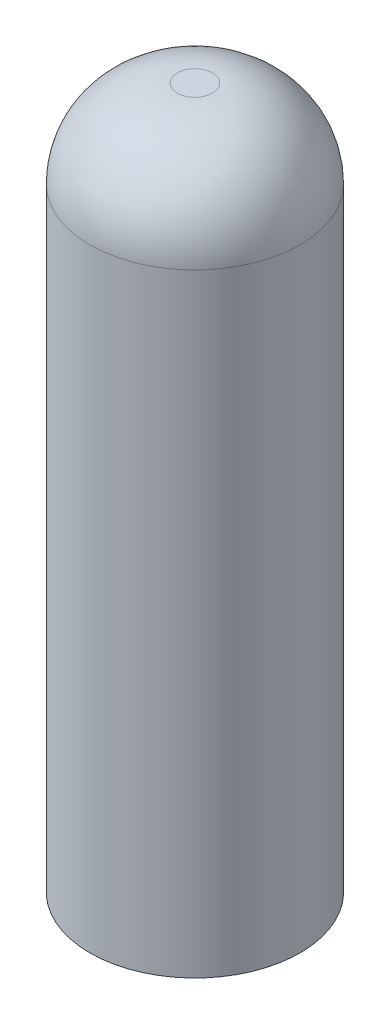
ISO-10303-21;
HEADER;
FILE_DESCRIPTION(('STEP AP214'),'2;1');
FILE_NAME('part.step','',(''),(''),'','','');
FILE_SCHEMA(('AUTOMOTIVE_DESIGN { 1 0 10303 214 1 1 1 1 }'));
ENDSEC;
DATA;
#1=APPLICATION_CONTEXT('core data for automotive mechanical design processes');
#2=APPLICATION_PROTOCOL_DEFINITION('international standard','automotive_design',2000,#1);
#3=PRODUCT_CONTEXT('',#1,'mechanical');
#4=PRODUCT('Part','Part','',(#3));
#5=PRODUCT_RELATED_PRODUCT_CATEGORY('part','',(#4));
#6=PRODUCT_DEFINITION_FORMATION('','',#4);
#7=PRODUCT_DEFINITION_CONTEXT('part definition',#1,'design');
#8=PRODUCT_DEFINITION('design','',#6,#7);
#9=PRODUCT_DEFINITION_SHAPE('','',#8);
#10=(LENGTH_UNIT() NAMED_UNIT(*) SI_UNIT(.MILLI.,.METRE.));
#11=(NAMED_UNIT(*) PLANE_ANGLE_UNIT() SI_UNIT($,.RADIAN.));
#12=(NAMED_UNIT(*) SI_UNIT($,.STERADIAN.) SOLID_ANGLE_UNIT());
#13=UNCERTAINTY_MEASURE_WITH_UNIT(LENGTH_MEASURE(1.E-05),#10,'distance_accuracy_value','');
#14=(GEOMETRIC_REPRESENTATION_CONTEXT(3) GLOBAL_UNCERTAINTY_ASSIGNED_CONTEXT((#13)) GLOBAL_UNIT_ASSIGNED_CONTEXT((#10,
#11,#12)) REPRESENTATION_CONTEXT('',''));
#15=CARTESIAN_POINT('',(0.,0.,0.));
#16=DIRECTION('',(0.,0.,1.));
#17=DIRECTION('',(1.,0.,0.));
#18=AXIS2_PLACEMENT_3D('',#15,#16,#17);
#19=CARTESIAN_POINT('',(0.,40.,0.));
#20=DIRECTION('',(0.,-1.,0.));
#21=DIRECTION('',(0.,0.,-1.));
#22=AXIS2_PLACEMENT_3D('',#19,#20,#21);
#23=CYLINDRICAL_SURFACE('',#22,6.);
#24=CARTESIAN_POINT('',(0.,35.,0.));
#25=DIRECTION('',(0.,1.,0.));
#26=DIRECTION('',(0.,0.,1.));
#27=AXIS2_PLACEMENT_3D('',#24,#25,#26);
#28=CIRCLE('',#27,6.);
#29=CARTESIAN_POINT('',(0.,35.,6.));
#30=VERTEX_POINT('',#29);
#31=EDGE_CURVE('E10',#30,#30,#28,.F.);
#32=ORIENTED_EDGE('',*,*,#31,.T.);
#33=EDGE_LOOP('',(#32));
#34=FACE_BOUND('',#33,.T.);
#35=CARTESIAN_POINT('',(0.,0.,0.));
#36=DIRECTION('',(0.,1.,0.));
#37=DIRECTION('',(0.,0.,1.));
#38=AXIS2_PLACEMENT_3D('',#35,#36,#37);
#39=CIRCLE('',#38,6.);
#40=CARTESIAN_POINT('',(0.,0.,6.));
#41=VERTEX_POINT('',#40);
#42=EDGE_CURVE('E50',#41,#41,#39,.T.);
#43=ORIENTED_EDGE('',*,*,#42,.T.);
#44=EDGE_LOOP('',(#43));
#45=FACE_BOUND('',#44,.T.);
#46=ADVANCED_FACE('F37',(#34,#45),#23,.T.);
#47=CARTESIAN_POINT('',(0.,40.,0.));
#48=DIRECTION('',(0.,1.,0.));
#49=DIRECTION('',(0.,0.,1.));
#50=AXIS2_PLACEMENT_3D('',#47,#48,#49);
#51=PLANE('',#50);
#52=CARTESIAN_POINT('',(0.,40.,0.));
#53=DIRECTION('',(0.,1.,0.));
#54=DIRECTION('',(0.,0.,1.));
#55=AXIS2_PLACEMENT_3D('',#52,#53,#54);
#56=CIRCLE('',#55,0.999999999999999);
#57=CARTESIAN_POINT('',(0.,40.,0.999999999999999));
#58=VERTEX_POINT('',#57);
#59=EDGE_CURVE('E45',#58,#58,#56,.T.);
#60=ORIENTED_EDGE('',*,*,#59,.T.);
#61=EDGE_LOOP('',(#60));
#62=FACE_BOUND('',#61,.T.);
#63=ADVANCED_FACE('F78',(#62),#51,.T.);
#64=CARTESIAN_POINT('',(0.,0.,0.));
#65=DIRECTION('',(0.,1.,0.));
#66=DIRECTION('',(0.,0.,1.));
#67=AXIS2_PLACEMENT_3D('',#64,#65,#66);
#68=PLANE('',#67);
#69=CARTESIAN_POINT('',(0.,0.,0.));
#70=DIRECTION('',(0.,1.,0.));
#71=DIRECTION('',(0.,0.,1.));
#72=AXIS2_PLACEMENT_3D('',#69,#70,#71);
#73=CIRCLE('',#72,5.);
#74=CARTESIAN_POINT('',(0.,0.,5.));
#75=VERTEX_POINT('',#74);
#76=EDGE_CURVE('E58',#75,#75,#73,.T.);
#77=ORIENTED_EDGE('',*,*,#76,.T.);
#78=EDGE_LOOP('',(#77));
#79=FACE_BOUND('',#78,.T.);
#80=ORIENTED_EDGE('',*,*,#42,.F.);
#81=EDGE_LOOP('',(#80));
#82=FACE_BOUND('',#81,.T.);
#83=ADVANCED_FACE('F82',(#79,#82),#68,.F.);
#84=CARTESIAN_POINT('',(0.,35.,0.));
#85=DIRECTION('',(0.,1.,0.));
#86=DIRECTION('',(0.,0.,1.));
#87=AXIS2_PLACEMENT_3D('',#84,#85,#86);
#88=DEGENERATE_TOROIDAL_SURFACE('',#87,0.999999999999999,5.,.T.);
#89=ORIENTED_EDGE('',*,*,#31,.F.);
#90=EDGE_LOOP('',(#89));
#91=FACE_BOUND('',#90,.T.);
#92=ORIENTED_EDGE('',*,*,#59,.F.);
#93=EDGE_LOOP('',(#92));
#94=FACE_BOUND('',#93,.T.);
#95=ADVANCED_FACE('F39',(#91,#94),#88,.T.);
#96=CARTESIAN_POINT('',(0.,40.,0.));
#97=DIRECTION('',(0.,-1.,0.));
#98=DIRECTION('',(0.,0.,-1.));
#99=AXIS2_PLACEMENT_3D('',#96,#97,#98);
#100=CYLINDRICAL_SURFACE('',#99,5.);
#101=CARTESIAN_POINT('',(0.,30.,0.));
#102=DIRECTION('',(0.,1.,0.));
#103=DIRECTION('',(0.,0.,1.));
#104=AXIS2_PLACEMENT_3D('',#101,#102,#103);
#105=CIRCLE('',#104,5.);
#106=CARTESIAN_POINT('',(0.,30.,5.));
#107=VERTEX_POINT('',#106);
#108=EDGE_CURVE('E55',#107,#107,#105,.T.);
#109=ORIENTED_EDGE('',*,*,#108,.T.);
#110=EDGE_LOOP('',(#109));
#111=FACE_BOUND('',#110,.T.);
#112=ORIENTED_EDGE('',*,*,#76,.F.);
#113=EDGE_LOOP('',(#112));
#114=FACE_BOUND('',#113,.T.);
#115=ADVANCED_FACE('F66',(#111,#114),#100,.F.);
#116=CARTESIAN_POINT('',(0.,30.,0.));
#117=DIRECTION('',(0.,1.,0.));
#118=DIRECTION('',(0.,0.,1.));
#119=AXIS2_PLACEMENT_3D('',#116,#117,#118);
#120=PLANE('',#119);
#121=ORIENTED_EDGE('',*,*,#108,.F.);
#122=EDGE_LOOP('',(#121));
#123=FACE_BOUND('',#122,.T.);
#124=ADVANCED_FACE('F69',(#123),#120,.F.);
#125=CLOSED_SHELL('',(#46,#63,#83,#95,#115,#124));
#126=MANIFOLD_SOLID_BREP('B2',#125);
#127=ADVANCED_BREP_SHAPE_REPRESENTATION('',(#18,#126),#14);
#128=SHAPE_DEFINITION_REPRESENTATION(#9,#127);
ENDSEC;
END-ISO-10303-21;
